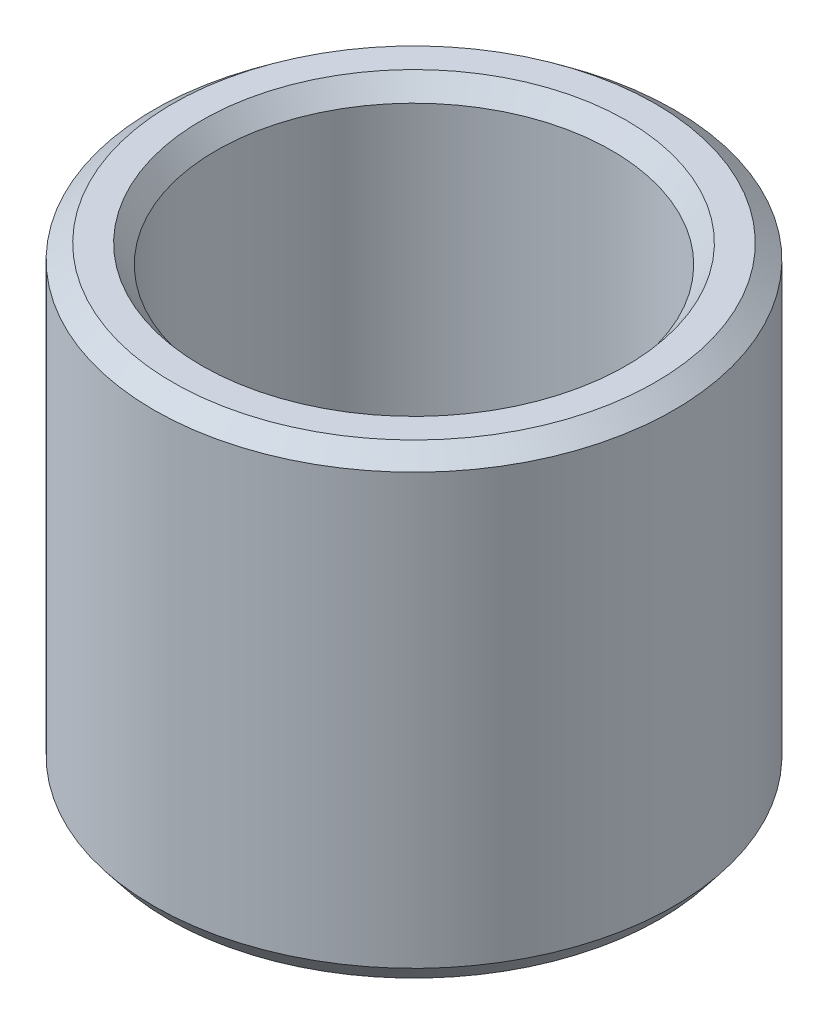
ISO-10303-21;
HEADER;
FILE_DESCRIPTION(('STEP AP214'),'2;1');
FILE_NAME('part.step','',(''),(''),'','','');
FILE_SCHEMA(('AUTOMOTIVE_DESIGN { 1 0 10303 214 1 1 1 1 }'));
ENDSEC;
DATA;
#1=APPLICATION_CONTEXT('core data for automotive mechanical design processes');
#2=APPLICATION_PROTOCOL_DEFINITION('international standard','automotive_design',2000,#1);
#3=PRODUCT_CONTEXT('',#1,'mechanical');
#4=PRODUCT('Part','Part','',(#3));
#5=PRODUCT_RELATED_PRODUCT_CATEGORY('part','',(#4));
#6=PRODUCT_DEFINITION_FORMATION('','',#4);
#7=PRODUCT_DEFINITION_CONTEXT('part definition',#1,'design');
#8=PRODUCT_DEFINITION('design','',#6,#7);
#9=PRODUCT_DEFINITION_SHAPE('','',#8);
#10=(LENGTH_UNIT() NAMED_UNIT(*) SI_UNIT(.MILLI.,.METRE.));
#11=(NAMED_UNIT(*) PLANE_ANGLE_UNIT() SI_UNIT($,.RADIAN.));
#12=(NAMED_UNIT(*) SI_UNIT($,.STERADIAN.) SOLID_ANGLE_UNIT());
#13=UNCERTAINTY_MEASURE_WITH_UNIT(LENGTH_MEASURE(1.E-05),#10,'distance_accuracy_value','');
#14=(GEOMETRIC_REPRESENTATION_CONTEXT(3) GLOBAL_UNCERTAINTY_ASSIGNED_CONTEXT((#13)) GLOBAL_UNIT_ASSIGNED_CONTEXT((#10,
#11,#12)) REPRESENTATION_CONTEXT('',''));
#15=CARTESIAN_POINT('',(0.,0.,0.));
#16=DIRECTION('',(0.,0.,1.));
#17=DIRECTION('',(1.,0.,0.));
#18=AXIS2_PLACEMENT_3D('',#15,#16,#17);
#19=CARTESIAN_POINT('',(0.,75.651781565108,0.));
#20=DIRECTION('',(0.,-1.,0.));
#21=DIRECTION('',(0.,0.,-1.));
#22=AXIS2_PLACEMENT_3D('',#19,#20,#21);
#23=CYLINDRICAL_SURFACE('',#22,42.5);
#24=CARTESIAN_POINT('',(0.,3.06970352262109,0.));
#25=DIRECTION('',(0.,1.,0.));
#26=DIRECTION('',(0.,0.,1.));
#27=AXIS2_PLACEMENT_3D('',#24,#25,#26);
#28=CIRCLE('',#27,42.5);
#29=CARTESIAN_POINT('',(0.,3.06970352262109,42.5));
#30=VERTEX_POINT('',#29);
#31=EDGE_CURVE('E10',#30,#30,#28,.T.);
#32=ORIENTED_EDGE('',*,*,#31,.T.);
#33=EDGE_LOOP('',(#32));
#34=FACE_BOUND('',#33,.T.);
#35=CARTESIAN_POINT('',(0.,73.2644274881396,0.));
#36=DIRECTION('',(0.,1.,0.));
#37=DIRECTION('',(0.,0.,1.));
#38=AXIS2_PLACEMENT_3D('',#35,#36,#37);
#39=CIRCLE('',#38,42.5);
#40=CARTESIAN_POINT('',(0.,73.2644274881396,-42.5));
#41=VERTEX_POINT('',#40);
#42=EDGE_CURVE('E50',#41,#41,#39,.F.);
#43=ORIENTED_EDGE('',*,*,#42,.T.);
#44=EDGE_LOOP('',(#43));
#45=FACE_BOUND('',#44,.T.);
#46=ADVANCED_FACE('F39',(#34,#45),#23,.T.);
#47=CARTESIAN_POINT('',(0.,75.651781565108,0.));
#48=DIRECTION('',(0.,1.,0.));
#49=DIRECTION('',(0.,0.,1.));
#50=AXIS2_PLACEMENT_3D('',#47,#48,#49);
#51=PLANE('',#50);
#52=CARTESIAN_POINT('',(0.,75.651781565108,0.));
#53=DIRECTION('',(0.,1.,0.));
#54=DIRECTION('',(0.,0.,1.));
#55=AXIS2_PLACEMENT_3D('',#52,#53,#54);
#56=CIRCLE('',#55,34.7043421748903);
#57=CARTESIAN_POINT('',(0.,75.651781565108,34.7043421748903));
#58=VERTEX_POINT('',#57);
#59=EDGE_CURVE('E58',#58,#58,#56,.F.);
#60=ORIENTED_EDGE('',*,*,#59,.T.);
#61=EDGE_LOOP('',(#60));
#62=FACE_BOUND('',#61,.T.);
#63=CARTESIAN_POINT('',(0.,75.651781565108,0.));
#64=DIRECTION('',(0.,1.,0.));
#65=DIRECTION('',(0.,0.,1.));
#66=AXIS2_PLACEMENT_3D('',#63,#64,#65);
#67=CIRCLE('',#66,39.4302964773789);
#68=CARTESIAN_POINT('',(0.,75.651781565108,-39.4302964773789));
#69=VERTEX_POINT('',#68);
#70=EDGE_CURVE('E61',#69,#69,#67,.T.);
#71=ORIENTED_EDGE('',*,*,#70,.T.);
#72=EDGE_LOOP('',(#71));
#73=FACE_BOUND('',#72,.T.);
#74=ADVANCED_FACE('F88',(#62,#73),#51,.T.);
#75=CARTESIAN_POINT('',(0.,0.,0.));
#76=DIRECTION('',(0.,1.,0.));
#77=DIRECTION('',(0.,0.,1.));
#78=AXIS2_PLACEMENT_3D('',#75,#76,#77);
#79=PLANE('',#78);
#80=CARTESIAN_POINT('',(0.,0.,0.));
#81=DIRECTION('',(0.,1.,0.));
#82=DIRECTION('',(0.,0.,1.));
#83=AXIS2_PLACEMENT_3D('',#80,#81,#82);
#84=CIRCLE('',#83,35.386691620543);
#85=CARTESIAN_POINT('',(0.,0.,35.386691620543));
#86=VERTEX_POINT('',#85);
#87=EDGE_CURVE('E51',#86,#86,#84,.T.);
#88=ORIENTED_EDGE('',*,*,#87,.T.);
#89=EDGE_LOOP('',(#88));
#90=FACE_BOUND('',#89,.T.);
#91=CARTESIAN_POINT('',(0.,0.,0.));
#92=DIRECTION('',(0.,1.,0.));
#93=DIRECTION('',(0.,0.,1.));
#94=AXIS2_PLACEMENT_3D('',#91,#92,#93);
#95=CIRCLE('',#94,40.1126459230316);
#96=CARTESIAN_POINT('',(0.,0.,40.1126459230316));
#97=VERTEX_POINT('',#96);
#98=EDGE_CURVE('E54',#97,#97,#95,.F.);
#99=ORIENTED_EDGE('',*,*,#98,.T.);
#100=EDGE_LOOP('',(#99));
#101=FACE_BOUND('',#100,.T.);
#102=ADVANCED_FACE('F83',(#90,#101),#79,.F.);
#103=CARTESIAN_POINT('',(0.,75.651781565108,0.));
#104=DIRECTION('',(0.,-1.,0.));
#105=DIRECTION('',(0.,0.,-1.));
#106=AXIS2_PLACEMENT_3D('',#103,#104,#105);
#107=CYLINDRICAL_SURFACE('',#106,32.3169880979219);
#108=CARTESIAN_POINT('',(0.,72.5820780424869,0.));
#109=DIRECTION('',(0.,1.,0.));
#110=DIRECTION('',(0.,0.,1.));
#111=AXIS2_PLACEMENT_3D('',#108,#109,#110);
#112=CIRCLE('',#111,32.3169880979219);
#113=CARTESIAN_POINT('',(0.,72.5820780424869,32.3169880979219));
#114=VERTEX_POINT('',#113);
#115=EDGE_CURVE('E67',#114,#114,#112,.T.);
#116=ORIENTED_EDGE('',*,*,#115,.T.);
#117=EDGE_LOOP('',(#116));
#118=FACE_BOUND('',#117,.T.);
#119=CARTESIAN_POINT('',(0.,2.38735407696836,0.));
#120=DIRECTION('',(0.,1.,0.));
#121=DIRECTION('',(0.,0.,1.));
#122=AXIS2_PLACEMENT_3D('',#119,#120,#121);
#123=CIRCLE('',#122,32.3169880979219);
#124=CARTESIAN_POINT('',(0.,2.38735407696836,32.3169880979219));
#125=VERTEX_POINT('',#124);
#126=EDGE_CURVE('E69',#125,#125,#123,.F.);
#127=ORIENTED_EDGE('',*,*,#126,.T.);
#128=EDGE_LOOP('',(#127));
#129=FACE_BOUND('',#128,.T.);
#130=ADVANCED_FACE('F71',(#118,#129),#107,.F.);
#131=CARTESIAN_POINT('',(0.,72.5820780424869,0.));
#132=DIRECTION('',(0.,1.,0.));
#133=DIRECTION('',(0.,0.,1.));
#134=AXIS2_PLACEMENT_3D('',#131,#132,#133);
#135=CONICAL_SURFACE('',#134,32.3169880979219,0.661003971460815);
#136=ORIENTED_EDGE('',*,*,#59,.F.);
#137=EDGE_LOOP('',(#136));
#138=FACE_BOUND('',#137,.T.);
#139=ORIENTED_EDGE('',*,*,#115,.F.);
#140=EDGE_LOOP('',(#139));
#141=FACE_BOUND('',#140,.T.);
#142=ADVANCED_FACE('F77',(#138,#141),#135,.F.);
#143=CARTESIAN_POINT('',(0.,0.,0.));
#144=DIRECTION('',(0.,-1.,0.));
#145=DIRECTION('',(0.,0.,-1.));
#146=AXIS2_PLACEMENT_3D('',#143,#144,#145);
#147=CONICAL_SURFACE('',#146,35.386691620543,0.909792355334085);
#148=ORIENTED_EDGE('',*,*,#126,.F.);
#149=EDGE_LOOP('',(#148));
#150=FACE_BOUND('',#149,.T.);
#151=ORIENTED_EDGE('',*,*,#87,.F.);
#152=EDGE_LOOP('',(#151));
#153=FACE_BOUND('',#152,.T.);
#154=ADVANCED_FACE('F73',(#150,#153),#147,.F.);
#155=CARTESIAN_POINT('',(0.,3.06970352262109,0.));
#156=DIRECTION('',(0.,1.,0.));
#157=DIRECTION('',(0.,0.,1.));
#158=AXIS2_PLACEMENT_3D('',#155,#156,#157);
#159=CONICAL_SURFACE('',#158,42.5,0.661003971460815);
#160=ORIENTED_EDGE('',*,*,#98,.F.);
#161=EDGE_LOOP('',(#160));
#162=FACE_BOUND('',#161,.T.);
#163=ORIENTED_EDGE('',*,*,#31,.F.);
#164=EDGE_LOOP('',(#163));
#165=FACE_BOUND('',#164,.T.);
#166=ADVANCED_FACE('F76',(#162,#165),#159,.T.);
#167=CARTESIAN_POINT('',(0.,75.651781565108,0.));
#168=DIRECTION('',(0.,-1.,0.));
#169=DIRECTION('',(0.,0.,-1.));
#170=AXIS2_PLACEMENT_3D('',#167,#168,#169);
#171=CONICAL_SURFACE('',#170,39.4302964773789,0.909792355334085);
#172=CARTESIAN_POINT('',(0.,73.2644274881396,-42.5));
#173=CARTESIAN_POINT('',(0.,73.2892957597747,-42.4680239216394));
#174=CARTESIAN_POINT('',(0.,73.3141640314098,-42.4360478432788));
#175=CARTESIAN_POINT('',(0.,73.36390057468,-42.3720956865575));
#176=CARTESIAN_POINT('',(0.,73.3887688463151,-42.3401196081968));
#177=CARTESIAN_POINT('',(0.,73.4385053895852,-42.2761674514756));
#178=CARTESIAN_POINT('',(0.,73.4633736612203,-42.2441913731149));
#179=CARTESIAN_POINT('',(0.,73.5131102044905,-42.1802392163937));
#180=CARTESIAN_POINT('',(0.,73.5379784761256,-42.148263138033));
#181=CARTESIAN_POINT('',(0.,73.5877150193958,-42.0843109813117));
#182=CARTESIAN_POINT('',(0.,73.6125832910308,-42.0523349029511));
#183=CARTESIAN_POINT('',(0.,73.662319834301,-41.9883827462298));
#184=CARTESIAN_POINT('',(0.,73.6871881059361,-41.9564066678692));
#185=CARTESIAN_POINT('',(0.,73.7369246492063,-41.8924545111479));
#186=CARTESIAN_POINT('',(0.,73.7617929208414,-41.8604784327873));
#187=CARTESIAN_POINT('',(0.,73.8115294641115,-41.796526276066));
#188=CARTESIAN_POINT('',(0.,73.8363977357466,-41.7645501977054));
#189=CARTESIAN_POINT('',(0.,73.8861342790168,-41.7005980409841));
#190=CARTESIAN_POINT('',(0.,73.9110025506519,-41.6686219626235));
#191=CARTESIAN_POINT('',(0.,73.9607390939221,-41.6046698059022));
#192=CARTESIAN_POINT('',(0.,73.9856073655572,-41.5726937275415));
#193=CARTESIAN_POINT('',(0.,74.0353439088273,-41.5087415708203));
#194=CARTESIAN_POINT('',(0.,74.0602121804624,-41.4767654924596));
#195=CARTESIAN_POINT('',(0.,74.1099487237326,-41.4128133357384));
#196=CARTESIAN_POINT('',(0.,74.1348169953677,-41.3808372573777));
#197=CARTESIAN_POINT('',(0.,74.1845535386379,-41.3168851006564));
#198=CARTESIAN_POINT('',(0.,74.2094218102729,-41.2849090222958));
#199=CARTESIAN_POINT('',(0.,74.2591583535431,-41.2209568655745));
#200=CARTESIAN_POINT('',(0.,74.2840266251782,-41.1889807872139));
#201=CARTESIAN_POINT('',(0.,74.3337631684484,-41.1250286304926));
#202=CARTESIAN_POINT('',(0.,74.3586314400835,-41.093052552132));
#203=CARTESIAN_POINT('',(0.,74.4083679833536,-41.0291003954107));
#204=CARTESIAN_POINT('',(0.,74.4332362549887,-40.9971243170501));
#205=CARTESIAN_POINT('',(0.,74.4829727982589,-40.9331721603288));
#206=CARTESIAN_POINT('',(0.,74.507841069894,-40.9011960819682));
#207=CARTESIAN_POINT('',(0.,74.5575776131642,-40.8372439252469));
#208=CARTESIAN_POINT('',(0.,74.5824458847993,-40.8052678468863));
#209=CARTESIAN_POINT('',(0.,74.6321824280694,-40.741315690165));
#210=CARTESIAN_POINT('',(0.,74.6570506997045,-40.7093396118043));
#211=CARTESIAN_POINT('',(0.,74.7067872429747,-40.6453874550831));
#212=CARTESIAN_POINT('',(0.,74.7316555146098,-40.6134113767224));
#213=CARTESIAN_POINT('',(0.,74.78139205788,-40.5494592200012));
#214=CARTESIAN_POINT('',(0.,74.806260329515,-40.5174831416405));
#215=CARTESIAN_POINT('',(0.,74.8559968727852,-40.4535309849193));
#216=CARTESIAN_POINT('',(0.,74.8808651444203,-40.4215549065586));
#217=CARTESIAN_POINT('',(0.,74.9306016876905,-40.3576027498373));
#218=CARTESIAN_POINT('',(0.,74.9554699593256,-40.3256266714767));
#219=CARTESIAN_POINT('',(0.,75.0052065025957,-40.2616745147554));
#220=CARTESIAN_POINT('',(0.,75.0300747742308,-40.2296984363948));
#221=CARTESIAN_POINT('',(0.,75.079811317501,-40.1657462796735));
#222=CARTESIAN_POINT('',(0.,75.1046795891361,-40.1337702013129));
#223=CARTESIAN_POINT('',(0.,75.1544161324063,-40.0698180445916));
#224=CARTESIAN_POINT('',(0.,75.1792844040414,-40.037841966231));
#225=CARTESIAN_POINT('',(0.,75.2290209473115,-39.9738898095097));
#226=CARTESIAN_POINT('',(0.,75.2538892189466,-39.9419137311491));
#227=CARTESIAN_POINT('',(0.,75.3036257622168,-39.8779615744278));
#228=CARTESIAN_POINT('',(0.,75.3284940338519,-39.8459854960672));
#229=CARTESIAN_POINT('',(0.,75.3782305771221,-39.7820333393459));
#230=CARTESIAN_POINT('',(0.,75.4030988487571,-39.7500572609852));
#231=CARTESIAN_POINT('',(0.,75.4528353920273,-39.686105104264));
#232=CARTESIAN_POINT('',(0.,75.4777036636624,-39.6541290259033));
#233=CARTESIAN_POINT('',(0.,75.5274402069326,-39.5901768691821));
#234=CARTESIAN_POINT('',(0.,75.5523084785677,-39.5582007908214));
#235=CARTESIAN_POINT('',(0.,75.6020450218378,-39.4942486341001));
#236=CARTESIAN_POINT('',(0.,75.6269132934729,-39.4622725557395));
#237=CARTESIAN_POINT('',(0.,75.651781565108,-39.4302964773789));
#238=B_SPLINE_CURVE_WITH_KNOTS('',3,(#172,#173,#174,#175,#176,#177,#178,#179,#180,#181,#182,
#183,#184,#185,#186,#187,#188,#189,#190,#191,#192,#193,#194,#195,#196,#197,#198,#199,#200,#201,
#202,#203,#204,#205,#206,#207,#208,#209,#210,#211,#212,#213,#214,#215,#216,#217,#218,#219,#220,
#221,#222,#223,#224,#225,#226,#227,#228,#229,#230,#231,#232,#233,#234,#235,#236,#237),
.UNSPECIFIED.,.F.,.F.,(4,2,2,2,2,2,2,2,2,2,2,2,2,2,2,2,2,2,2,2,2,2,2,2,2,2,2,2,2,2,2,2,4),(0.,
0.121524090998375,0.243048181996741,0.364572272995101,0.486096363993462,0.607620454991828,
0.729144545990194,0.850668636988555,0.972192727986921,1.09371681898529,1.21524090998366,
1.33676500098202,1.45828909198038,1.57981318297874,1.70133727397711,1.82286136497547,
1.94438545597384,2.06590954697221,2.18743363797057,2.30895772896893,2.4304818199673,
2.55200591096566,2.67353000196403,2.79505409296239,2.91657818396075,3.03810227495912,
3.15962636595749,3.28115045695585,3.40267454795421,3.52419863895257,3.64572272995094,
3.7672468209493,3.88877091194768),.UNSPECIFIED.);
#239=EDGE_CURVE('BSEAM45',#41,#69,#238,.T.);
#240=ORIENTED_EDGE('',*,*,#42,.F.);
#241=ORIENTED_EDGE('',*,*,#70,.F.);
#242=ORIENTED_EDGE('',*,*,#239,.T.);
#243=ORIENTED_EDGE('',*,*,#239,.F.);
#244=EDGE_LOOP('',(#240,#242,#241,#243));
#245=FACE_BOUND('',#244,.T.);
#246=ADVANCED_FACE('F45',(#245),#171,.T.);
#247=CLOSED_SHELL('',(#46,#74,#102,#130,#142,#154,#166,#246));
#248=MANIFOLD_SOLID_BREP('B2',#247);
#249=ADVANCED_BREP_SHAPE_REPRESENTATION('',(#18,#248),#14);
#250=SHAPE_DEFINITION_REPRESENTATION(#9,#249);
ENDSEC;
END-ISO-10303-21;
